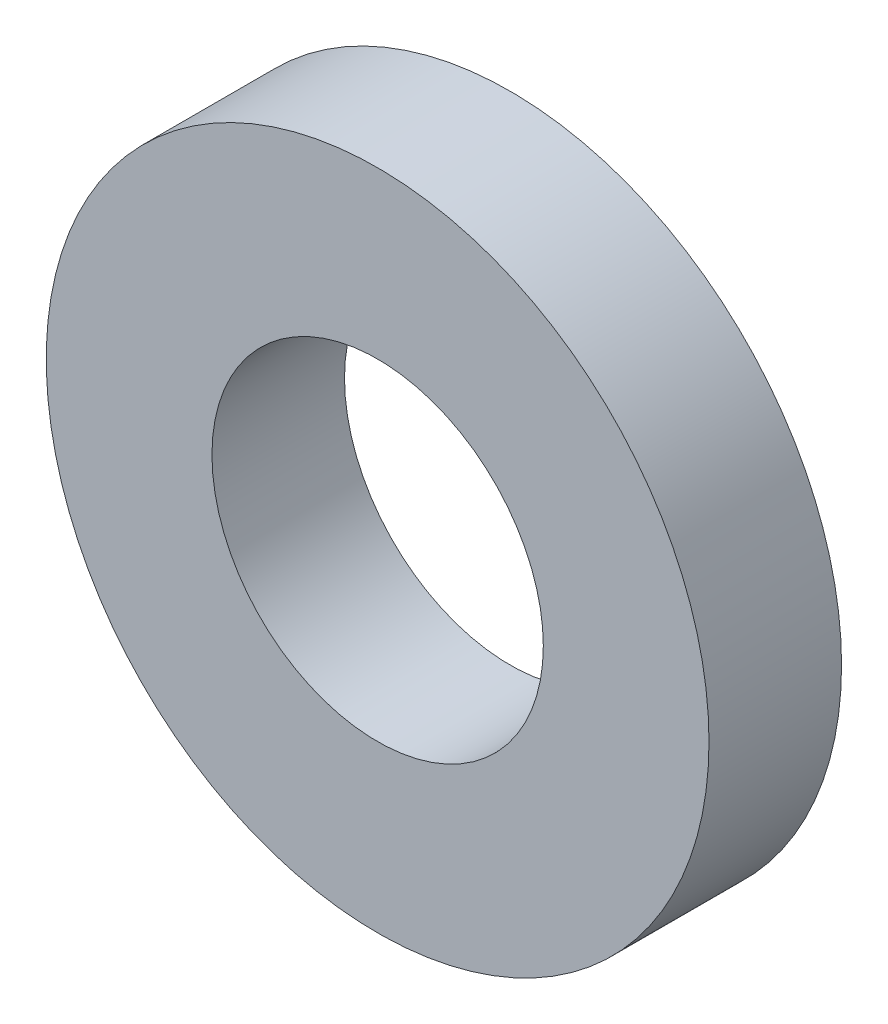
ISO-10303-21;
HEADER;
FILE_DESCRIPTION(('STEP AP214'),'2;1');
FILE_NAME('part.step','',(''),(''),'','','');
FILE_SCHEMA(('AUTOMOTIVE_DESIGN { 1 0 10303 214 1 1 1 1 }'));
ENDSEC;
DATA;
#1=APPLICATION_CONTEXT('core data for automotive mechanical design processes');
#2=APPLICATION_PROTOCOL_DEFINITION('international standard','automotive_design',2000,#1);
#3=PRODUCT_CONTEXT('',#1,'mechanical');
#4=PRODUCT('Part','Part','',(#3));
#5=PRODUCT_RELATED_PRODUCT_CATEGORY('part','',(#4));
#6=PRODUCT_DEFINITION_FORMATION('','',#4);
#7=PRODUCT_DEFINITION_CONTEXT('part definition',#1,'design');
#8=PRODUCT_DEFINITION('design','',#6,#7);
#9=PRODUCT_DEFINITION_SHAPE('','',#8);
#10=(LENGTH_UNIT() NAMED_UNIT(*) SI_UNIT(.MILLI.,.METRE.));
#11=(NAMED_UNIT(*) PLANE_ANGLE_UNIT() SI_UNIT($,.RADIAN.));
#12=(NAMED_UNIT(*) SI_UNIT($,.STERADIAN.) SOLID_ANGLE_UNIT());
#13=UNCERTAINTY_MEASURE_WITH_UNIT(LENGTH_MEASURE(1.E-05),#10,'distance_accuracy_value','');
#14=(GEOMETRIC_REPRESENTATION_CONTEXT(3) GLOBAL_UNCERTAINTY_ASSIGNED_CONTEXT((#13)) GLOBAL_UNIT_ASSIGNED_CONTEXT((#10,
#11,#12)) REPRESENTATION_CONTEXT('',''));
#15=CARTESIAN_POINT('',(0.,0.,0.));
#16=DIRECTION('',(0.,0.,1.));
#17=DIRECTION('',(1.,0.,0.));
#18=AXIS2_PLACEMENT_3D('',#15,#16,#17);
#19=CARTESIAN_POINT('',(0.,0.,4.));
#20=DIRECTION('',(0.,0.,-1.));
#21=DIRECTION('',(-1.,0.,0.));
#22=AXIS2_PLACEMENT_3D('',#19,#20,#21);
#23=CYLINDRICAL_SURFACE('',#22,10.);
#24=CARTESIAN_POINT('',(0.,0.,4.));
#25=DIRECTION('',(0.,0.,1.));
#26=DIRECTION('',(1.,0.,0.));
#27=AXIS2_PLACEMENT_3D('',#24,#25,#26);
#28=CIRCLE('',#27,10.);
#29=CARTESIAN_POINT('',(10.,0.,4.));
#30=VERTEX_POINT('',#29);
#31=EDGE_CURVE('E10',#30,#30,#28,.T.);
#32=ORIENTED_EDGE('',*,*,#31,.F.);
#33=EDGE_LOOP('',(#32));
#34=FACE_BOUND('',#33,.T.);
#35=CARTESIAN_POINT('',(0.,0.,0.));
#36=DIRECTION('',(0.,0.,1.));
#37=DIRECTION('',(1.,0.,0.));
#38=AXIS2_PLACEMENT_3D('',#35,#36,#37);
#39=CIRCLE('',#38,10.);
#40=CARTESIAN_POINT('',(10.,0.,0.));
#41=VERTEX_POINT('',#40);
#42=EDGE_CURVE('E34',#41,#41,#39,.T.);
#43=ORIENTED_EDGE('',*,*,#42,.T.);
#44=EDGE_LOOP('',(#43));
#45=FACE_BOUND('',#44,.T.);
#46=ADVANCED_FACE('F31',(#34,#45),#23,.T.);
#47=CARTESIAN_POINT('',(0.,0.,4.));
#48=DIRECTION('',(0.,0.,1.));
#49=DIRECTION('',(1.,0.,0.));
#50=AXIS2_PLACEMENT_3D('',#47,#48,#49);
#51=PLANE('',#50);
#52=CARTESIAN_POINT('',(0.,0.,4.));
#53=DIRECTION('',(0.,0.,1.));
#54=DIRECTION('',(1.,0.,0.));
#55=AXIS2_PLACEMENT_3D('',#52,#53,#54);
#56=CIRCLE('',#55,5.);
#57=CARTESIAN_POINT('',(5.,0.,4.));
#58=VERTEX_POINT('',#57);
#59=EDGE_CURVE('E43',#58,#58,#56,.T.);
#60=ORIENTED_EDGE('',*,*,#59,.F.);
#61=EDGE_LOOP('',(#60));
#62=FACE_BOUND('',#61,.T.);
#63=ORIENTED_EDGE('',*,*,#31,.T.);
#64=EDGE_LOOP('',(#63));
#65=FACE_BOUND('',#64,.T.);
#66=ADVANCED_FACE('F58',(#62,#65),#51,.T.);
#67=CARTESIAN_POINT('',(0.,0.,0.));
#68=DIRECTION('',(0.,0.,1.));
#69=DIRECTION('',(1.,0.,0.));
#70=AXIS2_PLACEMENT_3D('',#67,#68,#69);
#71=PLANE('',#70);
#72=CARTESIAN_POINT('',(0.,0.,0.));
#73=DIRECTION('',(0.,0.,1.));
#74=DIRECTION('',(1.,0.,0.));
#75=AXIS2_PLACEMENT_3D('',#72,#73,#74);
#76=CIRCLE('',#75,5.);
#77=CARTESIAN_POINT('',(5.,0.,0.));
#78=VERTEX_POINT('',#77);
#79=EDGE_CURVE('E41',#78,#78,#76,.T.);
#80=ORIENTED_EDGE('',*,*,#79,.T.);
#81=EDGE_LOOP('',(#80));
#82=FACE_BOUND('',#81,.T.);
#83=ORIENTED_EDGE('',*,*,#42,.F.);
#84=EDGE_LOOP('',(#83));
#85=FACE_BOUND('',#84,.T.);
#86=ADVANCED_FACE('F49',(#82,#85),#71,.F.);
#87=CARTESIAN_POINT('',(0.,0.,0.));
#88=DIRECTION('',(0.,0.,1.));
#89=DIRECTION('',(1.,0.,0.));
#90=AXIS2_PLACEMENT_3D('',#87,#88,#89);
#91=CYLINDRICAL_SURFACE('',#90,5.);
#92=ORIENTED_EDGE('',*,*,#79,.F.);
#93=EDGE_LOOP('',(#92));
#94=FACE_BOUND('',#93,.T.);
#95=ORIENTED_EDGE('',*,*,#59,.T.);
#96=EDGE_LOOP('',(#95));
#97=FACE_BOUND('',#96,.T.);
#98=ADVANCED_FACE('F52',(#94,#97),#91,.F.);
#99=CLOSED_SHELL('',(#46,#66,#86,#98));
#100=MANIFOLD_SOLID_BREP('B2',#99);
#101=ADVANCED_BREP_SHAPE_REPRESENTATION('',(#18,#100),#14);
#102=SHAPE_DEFINITION_REPRESENTATION(#9,#101);
ENDSEC;
END-ISO-10303-21;
